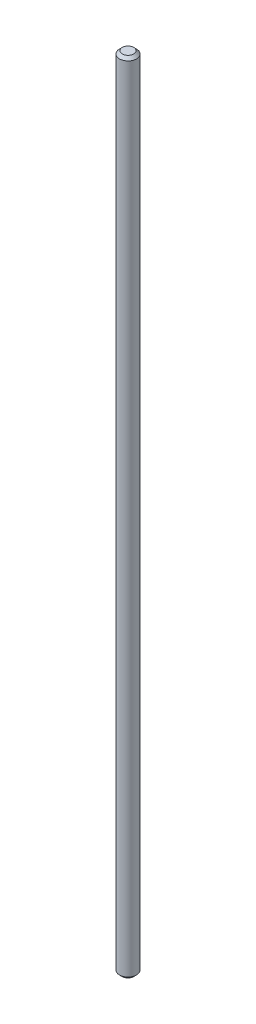
ISO-10303-21;
HEADER;
FILE_DESCRIPTION(('STEP AP214'),'2;1');
FILE_NAME('part.step','',(''),(''),'','','');
FILE_SCHEMA(('AUTOMOTIVE_DESIGN { 1 0 10303 214 1 1 1 1 }'));
ENDSEC;
DATA;
#1=APPLICATION_CONTEXT('core data for automotive mechanical design processes');
#2=APPLICATION_PROTOCOL_DEFINITION('international standard','automotive_design',2000,#1);
#3=PRODUCT_CONTEXT('',#1,'mechanical');
#4=PRODUCT('Part','Part','',(#3));
#5=PRODUCT_RELATED_PRODUCT_CATEGORY('part','',(#4));
#6=PRODUCT_DEFINITION_FORMATION('','',#4);
#7=PRODUCT_DEFINITION_CONTEXT('part definition',#1,'design');
#8=PRODUCT_DEFINITION('design','',#6,#7);
#9=PRODUCT_DEFINITION_SHAPE('','',#8);
#10=(LENGTH_UNIT() NAMED_UNIT(*) SI_UNIT(.MILLI.,.METRE.));
#11=(NAMED_UNIT(*) PLANE_ANGLE_UNIT() SI_UNIT($,.RADIAN.));
#12=(NAMED_UNIT(*) SI_UNIT($,.STERADIAN.) SOLID_ANGLE_UNIT());
#13=UNCERTAINTY_MEASURE_WITH_UNIT(LENGTH_MEASURE(1.E-05),#10,'distance_accuracy_value','');
#14=(GEOMETRIC_REPRESENTATION_CONTEXT(3) GLOBAL_UNCERTAINTY_ASSIGNED_CONTEXT((#13)) GLOBAL_UNIT_ASSIGNED_CONTEXT((#10,
#11,#12)) REPRESENTATION_CONTEXT('',''));
#15=CARTESIAN_POINT('',(0.,0.,0.));
#16=DIRECTION('',(0.,0.,1.));
#17=DIRECTION('',(1.,0.,0.));
#18=AXIS2_PLACEMENT_3D('',#15,#16,#17);
#19=CARTESIAN_POINT('',(0.,140.,0.));
#20=DIRECTION('',(0.,-1.,0.));
#21=DIRECTION('',(0.,0.,-1.));
#22=AXIS2_PLACEMENT_3D('',#19,#20,#21);
#23=CYLINDRICAL_SURFACE('',#22,1.5);
#24=CARTESIAN_POINT('',(0.,139.5,0.));
#25=DIRECTION('',(0.,1.,0.));
#26=DIRECTION('',(0.,0.,1.));
#27=AXIS2_PLACEMENT_3D('',#24,#25,#26);
#28=CIRCLE('',#27,1.5);
#29=CARTESIAN_POINT('',(0.,139.5,1.5));
#30=VERTEX_POINT('',#29);
#31=EDGE_CURVE('E41',#30,#30,#28,.F.);
#32=ORIENTED_EDGE('',*,*,#31,.T.);
#33=EDGE_LOOP('',(#32));
#34=FACE_BOUND('',#33,.T.);
#35=CARTESIAN_POINT('',(0.,0.5,0.));
#36=DIRECTION('',(0.,1.,0.));
#37=DIRECTION('',(0.,0.,1.));
#38=AXIS2_PLACEMENT_3D('',#35,#36,#37);
#39=CIRCLE('',#38,1.5);
#40=CARTESIAN_POINT('',(0.,0.5,1.5));
#41=VERTEX_POINT('',#40);
#42=EDGE_CURVE('E45',#41,#41,#39,.T.);
#43=ORIENTED_EDGE('',*,*,#42,.T.);
#44=EDGE_LOOP('',(#43));
#45=FACE_BOUND('',#44,.T.);
#46=ADVANCED_FACE('F34',(#34,#45),#23,.T.);
#47=CARTESIAN_POINT('',(0.,140.,0.));
#48=DIRECTION('',(0.,1.,0.));
#49=DIRECTION('',(0.,0.,1.));
#50=AXIS2_PLACEMENT_3D('',#47,#48,#49);
#51=PLANE('',#50);
#52=CARTESIAN_POINT('',(0.,140.,0.));
#53=DIRECTION('',(0.,1.,0.));
#54=DIRECTION('',(0.,0.,1.));
#55=AXIS2_PLACEMENT_3D('',#52,#53,#54);
#56=CIRCLE('',#55,1.00000000000001);
#57=CARTESIAN_POINT('',(0.,140.,1.00000000000001));
#58=VERTEX_POINT('',#57);
#59=EDGE_CURVE('E49',#58,#58,#56,.T.);
#60=ORIENTED_EDGE('',*,*,#59,.T.);
#61=EDGE_LOOP('',(#60));
#62=FACE_BOUND('',#61,.T.);
#63=ADVANCED_FACE('F55',(#62),#51,.T.);
#64=CARTESIAN_POINT('',(0.,0.,0.));
#65=DIRECTION('',(0.,1.,0.));
#66=DIRECTION('',(0.,0.,1.));
#67=AXIS2_PLACEMENT_3D('',#64,#65,#66);
#68=PLANE('',#67);
#69=CARTESIAN_POINT('',(0.,0.,0.));
#70=DIRECTION('',(0.,1.,0.));
#71=DIRECTION('',(0.,0.,1.));
#72=AXIS2_PLACEMENT_3D('',#69,#70,#71);
#73=CIRCLE('',#72,1.);
#74=CARTESIAN_POINT('',(0.,0.,1.));
#75=VERTEX_POINT('',#74);
#76=EDGE_CURVE('E10',#75,#75,#73,.F.);
#77=ORIENTED_EDGE('',*,*,#76,.T.);
#78=EDGE_LOOP('',(#77));
#79=FACE_BOUND('',#78,.T.);
#80=ADVANCED_FACE('F59',(#79),#68,.F.);
#81=CARTESIAN_POINT('',(0.,140.,0.));
#82=DIRECTION('',(0.,-1.,0.));
#83=DIRECTION('',(0.,0.,-1.));
#84=AXIS2_PLACEMENT_3D('',#81,#82,#83);
#85=CONICAL_SURFACE('',#84,1.00000000000001,0.785398163397433);
#86=ORIENTED_EDGE('',*,*,#31,.F.);
#87=EDGE_LOOP('',(#86));
#88=FACE_BOUND('',#87,.T.);
#89=ORIENTED_EDGE('',*,*,#59,.F.);
#90=EDGE_LOOP('',(#89));
#91=FACE_BOUND('',#90,.T.);
#92=ADVANCED_FACE('F57',(#88,#91),#85,.T.);
#93=CARTESIAN_POINT('',(0.,0.5,0.));
#94=DIRECTION('',(0.,1.,0.));
#95=DIRECTION('',(0.,0.,1.));
#96=AXIS2_PLACEMENT_3D('',#93,#94,#95);
#97=CONICAL_SURFACE('',#96,1.5,0.785398163397447);
#98=ORIENTED_EDGE('',*,*,#76,.F.);
#99=EDGE_LOOP('',(#98));
#100=FACE_BOUND('',#99,.T.);
#101=ORIENTED_EDGE('',*,*,#42,.F.);
#102=EDGE_LOOP('',(#101));
#103=FACE_BOUND('',#102,.T.);
#104=ADVANCED_FACE('F36',(#100,#103),#97,.T.);
#105=CLOSED_SHELL('',(#46,#63,#80,#92,#104));
#106=MANIFOLD_SOLID_BREP('B2',#105);
#107=ADVANCED_BREP_SHAPE_REPRESENTATION('',(#18,#106),#14);
#108=SHAPE_DEFINITION_REPRESENTATION(#9,#107);
ENDSEC;
END-ISO-10303-21;
